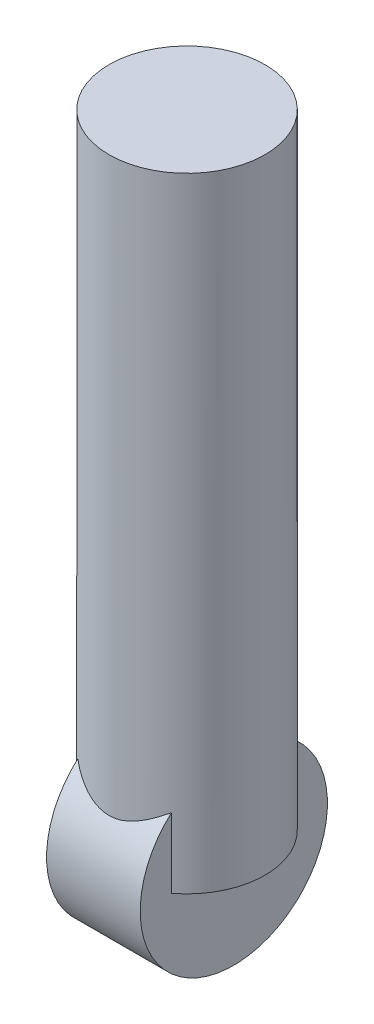
ISO-10303-21;
HEADER;
FILE_DESCRIPTION(('STEP AP214'),'2;1');
FILE_NAME('part.step','',(''),(''),'','','');
FILE_SCHEMA(('AUTOMOTIVE_DESIGN { 1 0 10303 214 1 1 1 1 }'));
ENDSEC;
DATA;
#1=APPLICATION_CONTEXT('core data for automotive mechanical design processes');
#2=APPLICATION_PROTOCOL_DEFINITION('international standard','automotive_design',2000,#1);
#3=PRODUCT_CONTEXT('',#1,'mechanical');
#4=PRODUCT('Part','Part','',(#3));
#5=PRODUCT_RELATED_PRODUCT_CATEGORY('part','',(#4));
#6=PRODUCT_DEFINITION_FORMATION('','',#4);
#7=PRODUCT_DEFINITION_CONTEXT('part definition',#1,'design');
#8=PRODUCT_DEFINITION('design','',#6,#7);
#9=PRODUCT_DEFINITION_SHAPE('','',#8);
#10=(LENGTH_UNIT() NAMED_UNIT(*) SI_UNIT(.MILLI.,.METRE.));
#11=(NAMED_UNIT(*) PLANE_ANGLE_UNIT() SI_UNIT($,.RADIAN.));
#12=(NAMED_UNIT(*) SI_UNIT($,.STERADIAN.) SOLID_ANGLE_UNIT());
#13=UNCERTAINTY_MEASURE_WITH_UNIT(LENGTH_MEASURE(1.E-05),#10,'distance_accuracy_value','');
#14=(GEOMETRIC_REPRESENTATION_CONTEXT(3) GLOBAL_UNCERTAINTY_ASSIGNED_CONTEXT((#13)) GLOBAL_UNIT_ASSIGNED_CONTEXT((#10,
#11,#12)) REPRESENTATION_CONTEXT('',''));
#15=CARTESIAN_POINT('',(0.,0.,0.));
#16=DIRECTION('',(0.,0.,1.));
#17=DIRECTION('',(1.,0.,0.));
#18=AXIS2_PLACEMENT_3D('',#15,#16,#17);
#19=CARTESIAN_POINT('',(0.,0.,0.));
#20=DIRECTION('',(0.,1.,0.));
#21=DIRECTION('',(0.,0.,1.));
#22=AXIS2_PLACEMENT_3D('',#19,#20,#21);
#23=PLANE('',#22);
#24=DIRECTION('',(0.,0.,-1.));
#25=VECTOR('',#24,1.);
#26=CARTESIAN_POINT('',(-15.,0.,0.));
#27=LINE('',#26,#25);
#28=CARTESIAN_POINT('',(-15.,0.,20.));
#29=VERTEX_POINT('',#28);
#30=CARTESIAN_POINT('',(-15.,0.,-20.));
#31=VERTEX_POINT('',#30);
#32=EDGE_CURVE('E77',#29,#31,#27,.T.);
#33=ORIENTED_EDGE('',*,*,#32,.F.);
#34=CARTESIAN_POINT('',(0.,0.,0.));
#35=DIRECTION('',(0.,1.,0.));
#36=DIRECTION('',(0.,0.,1.));
#37=AXIS2_PLACEMENT_3D('',#34,#35,#36);
#38=CIRCLE('',#37,25.);
#39=EDGE_CURVE('E74',#31,#29,#38,.T.);
#40=ORIENTED_EDGE('',*,*,#39,.F.);
#41=EDGE_LOOP('',(#33,#40));
#42=FACE_BOUND('',#41,.T.);
#43=ADVANCED_FACE('F33',(#42),#23,.F.);
#44=CARTESIAN_POINT('',(0.,200.,0.));
#45=DIRECTION('',(0.,-1.,0.));
#46=DIRECTION('',(0.,0.,-1.));
#47=AXIS2_PLACEMENT_3D('',#44,#45,#46);
#48=CYLINDRICAL_SURFACE('',#47,25.);
#49=CARTESIAN_POINT('',(0.,200.,0.));
#50=DIRECTION('',(0.,1.,0.));
#51=DIRECTION('',(0.,0.,1.));
#52=AXIS2_PLACEMENT_3D('',#49,#50,#51);
#53=CIRCLE('',#52,25.);
#54=CARTESIAN_POINT('',(0.,200.,25.));
#55=VERTEX_POINT('',#54);
#56=EDGE_CURVE('E91',#55,#55,#53,.T.);
#57=ORIENTED_EDGE('',*,*,#56,.F.);
#58=EDGE_LOOP('',(#57));
#59=FACE_BOUND('',#58,.T.);
#60=CARTESIAN_POINT('',(15.,22.3606797749979,20.));
#61=CARTESIAN_POINT('',(14.7505333881141,22.1933485372813,20.1870895665549));
#62=CARTESIAN_POINT('',(14.4976013701805,22.0259572678637,20.3695059629026));
#63=CARTESIAN_POINT('',(13.984770955398,21.6918369729914,20.7249518961479));
#64=CARTESIAN_POINT('',(13.7248721377267,21.5251079882428,20.8979808640899));
#65=CARTESIAN_POINT('',(13.1976277860819,21.1928156750195,21.2348922647635));
#66=CARTESIAN_POINT('',(12.9302696683643,21.0272549908232,21.3987576405117));
#67=CARTESIAN_POINT('',(12.3885020958379,20.6985188623841,21.7168984063848));
#68=CARTESIAN_POINT('',(12.1140927527183,20.5353433804246,21.8711739482772));
#69=CARTESIAN_POINT('',(11.2700786282488,20.0449958391043,22.3248405224954));
#70=CARTESIAN_POINT('',(10.6891224965952,19.7230262297724,22.6090206517832));
#71=CARTESIAN_POINT('',(9.49659072166293,19.1030348384226,23.1352356240808));
#72=CARTESIAN_POINT('',(8.88503994538071,18.8049941045188,23.3773040008827));
#73=CARTESIAN_POINT('',(7.84497126030824,18.3414168283971,23.7412569494084));
#74=CARTESIAN_POINT('',(7.42554436785161,18.1654721131729,23.8759003965315));
#75=CARTESIAN_POINT('',(6.57269431708134,17.8338429677432,24.1246132853297));
#76=CARTESIAN_POINT('',(6.13927123624068,17.6781584254157,24.2386828408642));
#77=CARTESIAN_POINT('',(5.261423217624,17.3928527883917,24.4442112064521));
#78=CARTESIAN_POINT('',(4.81707354927075,17.2630905180977,24.5357931494226));
#79=CARTESIAN_POINT('',(3.91648086673883,17.0337748290413,24.6955487715468));
#80=CARTESIAN_POINT('',(3.46024048448537,16.9342147858703,24.7637275842607));
#81=CARTESIAN_POINT('',(2.60836453973929,16.7825948550927,24.8666761486076));
#82=CARTESIAN_POINT('',(2.21402771683465,16.7256218974077,24.9049439308804));
#83=CARTESIAN_POINT('',(1.42097583704049,16.639228632694,24.9627485080242));
#84=CARTESIAN_POINT('',(1.02226128597008,16.6098051756924,24.9822874443324));
#85=CARTESIAN_POINT('',(0.22327171187946,16.5798220058181,25.002196623743));
#86=CARTESIAN_POINT('',(-0.177003258856212,16.5792613340217,25.0025675036759));
#87=CARTESIAN_POINT('',(-0.976109394506941,16.6070260295593,24.9841340399335));
#88=CARTESIAN_POINT('',(-1.37494049988374,16.6353525747534,24.9653289143673));
#89=CARTESIAN_POINT('',(-2.16652030714677,16.7194363193586,24.9090939713156));
#90=CARTESIAN_POINT('',(-2.55928822229833,16.7750704045384,24.8717477366118));
#91=CARTESIAN_POINT('',(-3.33825617041809,16.9114406924301,24.7792237557744));
#92=CARTESIAN_POINT('',(-3.72445612185149,16.9921772065243,24.7240457884473));
#93=CARTESIAN_POINT('',(-4.48928022795227,17.1760165443721,24.5966855087843));
#94=CARTESIAN_POINT('',(-4.86789073337734,17.2791562966902,24.5244751038009));
#95=CARTESIAN_POINT('',(-5.61594559196705,17.5046161277312,24.3640631842886));
#96=CARTESIAN_POINT('',(-5.98538705582526,17.6269421656536,24.2758567000938));
#97=CARTESIAN_POINT('',(-6.97225053139139,17.9798301419036,24.0166958440562));
#98=CARTESIAN_POINT('',(-7.5804248065674,18.2257927114594,23.8313141160917));
#99=CARTESIAN_POINT('',(-8.76829425211815,18.750965046318,23.4203460224254));
#100=CARTESIAN_POINT('',(-9.34796706675509,19.0302003401414,23.1947287191774));
#101=CARTESIAN_POINT('',(-10.4802234271221,19.6111911751606,22.705629254342));
#102=CARTESIAN_POINT('',(-11.0327738321779,19.9129731841759,22.4421022435035));
#103=CARTESIAN_POINT('',(-12.110917501539,20.5299551045294,21.8791065804401));
#104=CARTESIAN_POINT('',(-12.636524321464,20.8451481196217,21.5796562600433));
#105=CARTESIAN_POINT('',(-13.4681767181354,21.3618684651961,21.0653483528224));
#106=CARTESIAN_POINT('',(-13.7821935823242,21.5613800266166,20.8612391909664));
#107=CARTESIAN_POINT('',(-14.3990882722018,21.9608515795228,20.4402784136206));
#108=CARTESIAN_POINT('',(-14.7020030109163,22.1608071810555,20.2234767353799));
#109=CARTESIAN_POINT('',(-15.,22.3606797749979,20.));
#110=B_SPLINE_CURVE_WITH_KNOTS('',3,(#60,#61,#62,#63,#64,#65,#66,#67,#68,#69,#70,#71,#72,#73,
#74,#75,#76,#77,#78,#79,#80,#81,#82,#83,#84,#85,#86,#87,#88,#89,#90,#91,#92,#93,#94,#95,#96,#97,
#98,#99,#100,#101,#102,#103,#104,#105,#106,#107,#108,#109),.UNSPECIFIED.,.F.,.F.,(4,2,2,2,2,2,2,
2,2,2,2,2,2,2,2,2,2,2,2,2,2,2,2,2,4),(0.,1.06161246775771,2.12328920628106,3.18688050614905,
4.25045496945465,6.41569285532879,8.57919858005368,10.0013272937462,11.4234481368906,
12.837599105975,14.2514396774697,15.4509264069877,16.6502759720474,17.8495856904446,
19.0489443119757,20.2429446937337,21.4369598870242,22.6329583865508,23.8293290977455,
25.871119691797,27.9144870622562,29.9602920377655,32.0050574354383,33.2777990560276,
34.5458318973056),.UNSPECIFIED.);
#111=CARTESIAN_POINT('',(15.,22.3606797749979,20.));
#112=VERTEX_POINT('',#111);
#113=CARTESIAN_POINT('',(-15.,22.3606797749979,20.));
#114=VERTEX_POINT('',#113);
#115=EDGE_CURVE('E11',#112,#114,#110,.T.);
#116=ORIENTED_EDGE('',*,*,#115,.F.);
#117=DIRECTION('',(0.,-1.,0.));
#118=VECTOR('',#117,1.);
#119=CARTESIAN_POINT('',(15.,200.,20.));
#120=LINE('',#119,#118);
#121=CARTESIAN_POINT('',(15.,0.,20.));
#122=VERTEX_POINT('',#121);
#123=EDGE_CURVE('E79',#112,#122,#120,.T.);
#124=ORIENTED_EDGE('',*,*,#123,.T.);
#125=CARTESIAN_POINT('',(15.,0.,-20.));
#126=VERTEX_POINT('',#125);
#127=EDGE_CURVE('E78',#122,#126,#38,.T.);
#128=ORIENTED_EDGE('',*,*,#127,.T.);
#129=DIRECTION('',(0.,-1.,0.));
#130=VECTOR('',#129,1.);
#131=CARTESIAN_POINT('',(15.,200.,-20.));
#132=LINE('',#131,#130);
#133=CARTESIAN_POINT('',(15.,22.3606797749979,-20.));
#134=VERTEX_POINT('',#133);
#135=EDGE_CURVE('E166',#126,#134,#132,.F.);
#136=ORIENTED_EDGE('',*,*,#135,.T.);
#137=CARTESIAN_POINT('',(-15.,22.3606797749979,-20.));
#138=CARTESIAN_POINT('',(-14.7505333881141,22.1933485372813,-20.1870895665549));
#139=CARTESIAN_POINT('',(-14.4976013701805,22.0259572678637,-20.3695059629026));
#140=CARTESIAN_POINT('',(-13.984770955398,21.6918369729914,-20.7249518961479));
#141=CARTESIAN_POINT('',(-13.7248721377267,21.5251079882428,-20.8979808640899));
#142=CARTESIAN_POINT('',(-13.1976277860819,21.1928156750195,-21.2348922647635));
#143=CARTESIAN_POINT('',(-12.9302696683643,21.0272549908232,-21.3987576405117));
#144=CARTESIAN_POINT('',(-12.3885020958379,20.6985188623841,-21.7168984063848));
#145=CARTESIAN_POINT('',(-12.1140927527183,20.5353433804246,-21.8711739482772));
#146=CARTESIAN_POINT('',(-11.2700786282488,20.0449958391043,-22.3248405224954));
#147=CARTESIAN_POINT('',(-10.6891224965952,19.7230262297724,-22.6090206517832));
#148=CARTESIAN_POINT('',(-9.49659072166293,19.1030348384226,-23.1352356240808));
#149=CARTESIAN_POINT('',(-8.88503994538071,18.8049941045188,-23.3773040008827));
#150=CARTESIAN_POINT('',(-7.84497126030824,18.3414168283971,-23.7412569494084));
#151=CARTESIAN_POINT('',(-7.42554436785161,18.1654721131729,-23.8759003965315));
#152=CARTESIAN_POINT('',(-6.57269431708134,17.8338429677432,-24.1246132853297));
#153=CARTESIAN_POINT('',(-6.13927123624068,17.6781584254157,-24.2386828408642));
#154=CARTESIAN_POINT('',(-5.261423217624,17.3928527883917,-24.4442112064521));
#155=CARTESIAN_POINT('',(-4.81707354927075,17.2630905180977,-24.5357931494226));
#156=CARTESIAN_POINT('',(-3.91648086673883,17.0337748290413,-24.6955487715468));
#157=CARTESIAN_POINT('',(-3.46024048448537,16.9342147858703,-24.7637275842607));
#158=CARTESIAN_POINT('',(-2.60836453973929,16.7825948550927,-24.8666761486076));
#159=CARTESIAN_POINT('',(-2.21402771683465,16.7256218974077,-24.9049439308804));
#160=CARTESIAN_POINT('',(-1.42097583704049,16.639228632694,-24.9627485080242));
#161=CARTESIAN_POINT('',(-1.02226128597008,16.6098051756924,-24.9822874443324));
#162=CARTESIAN_POINT('',(-0.22327171187946,16.5798220058181,-25.002196623743));
#163=CARTESIAN_POINT('',(0.177003258856212,16.5792613340217,-25.0025675036759));
#164=CARTESIAN_POINT('',(0.976109394506941,16.6070260295593,-24.9841340399335));
#165=CARTESIAN_POINT('',(1.37494049988374,16.6353525747534,-24.9653289143673));
#166=CARTESIAN_POINT('',(2.16652030714677,16.7194363193586,-24.9090939713156));
#167=CARTESIAN_POINT('',(2.55928822229833,16.7750704045384,-24.8717477366118));
#168=CARTESIAN_POINT('',(3.33825617041809,16.9114406924301,-24.7792237557744));
#169=CARTESIAN_POINT('',(3.72445612185149,16.9921772065243,-24.7240457884473));
#170=CARTESIAN_POINT('',(4.48928022795227,17.1760165443721,-24.5966855087843));
#171=CARTESIAN_POINT('',(4.86789073337734,17.2791562966902,-24.5244751038009));
#172=CARTESIAN_POINT('',(5.61594559196705,17.5046161277312,-24.3640631842886));
#173=CARTESIAN_POINT('',(5.98538705582526,17.6269421656536,-24.2758567000938));
#174=CARTESIAN_POINT('',(6.97225053139139,17.9798301419036,-24.0166958440562));
#175=CARTESIAN_POINT('',(7.5804248065674,18.2257927114594,-23.8313141160917));
#176=CARTESIAN_POINT('',(8.76829425211815,18.750965046318,-23.4203460224254));
#177=CARTESIAN_POINT('',(9.34796706675509,19.0302003401414,-23.1947287191774));
#178=CARTESIAN_POINT('',(10.4802234271221,19.6111911751606,-22.705629254342));
#179=CARTESIAN_POINT('',(11.0327738321779,19.9129731841759,-22.4421022435035));
#180=CARTESIAN_POINT('',(12.110917501539,20.5299551045294,-21.8791065804401));
#181=CARTESIAN_POINT('',(12.636524321464,20.8451481196217,-21.5796562600433));
#182=CARTESIAN_POINT('',(13.4681767181354,21.3618684651961,-21.0653483528224));
#183=CARTESIAN_POINT('',(13.7821935823242,21.5613800266166,-20.8612391909664));
#184=CARTESIAN_POINT('',(14.3990882722018,21.9608515795228,-20.4402784136206));
#185=CARTESIAN_POINT('',(14.7020030109163,22.1608071810555,-20.2234767353799));
#186=CARTESIAN_POINT('',(15.,22.3606797749979,-20.));
#187=B_SPLINE_CURVE_WITH_KNOTS('',3,(#137,#138,#139,#140,#141,#142,#143,#144,#145,#146,#147,
#148,#149,#150,#151,#152,#153,#154,#155,#156,#157,#158,#159,#160,#161,#162,#163,#164,#165,#166,
#167,#168,#169,#170,#171,#172,#173,#174,#175,#176,#177,#178,#179,#180,#181,#182,#183,#184,#185,
#186),.UNSPECIFIED.,.F.,.F.,(4,2,2,2,2,2,2,2,2,2,2,2,2,2,2,2,2,2,2,2,2,2,2,2,4),(0.,
1.06161246775771,2.12328920628106,3.18688050614905,4.25045496945465,6.41569285532879,
8.57919858005368,10.0013272937462,11.4234481368906,12.837599105975,14.2514396774697,
15.4509264069877,16.6502759720474,17.8495856904446,19.0489443119757,20.2429446937337,
21.4369598870242,22.6329583865508,23.8293290977455,25.871119691797,27.9144870622562,
29.9602920377655,32.0050574354383,33.2777990560276,34.5458318973056),.UNSPECIFIED.);
#188=CARTESIAN_POINT('',(-15.,22.3606797749979,-20.));
#189=VERTEX_POINT('',#188);
#190=EDGE_CURVE('E46',#189,#134,#187,.T.);
#191=ORIENTED_EDGE('',*,*,#190,.F.);
#192=DIRECTION('',(0.,-1.,0.));
#193=VECTOR('',#192,1.);
#194=CARTESIAN_POINT('',(-15.,200.,-20.));
#195=LINE('',#194,#193);
#196=EDGE_CURVE('E82',#31,#189,#195,.F.);
#197=ORIENTED_EDGE('',*,*,#196,.F.);
#198=ORIENTED_EDGE('',*,*,#39,.T.);
#199=DIRECTION('',(0.,-1.,0.));
#200=VECTOR('',#199,1.);
#201=CARTESIAN_POINT('',(-15.,200.,20.));
#202=LINE('',#201,#200);
#203=EDGE_CURVE('E56',#114,#29,#202,.T.);
#204=ORIENTED_EDGE('',*,*,#203,.F.);
#205=EDGE_LOOP('',(#116,#124,#128,#136,#191,#197,#198,#204));
#206=FACE_BOUND('',#205,.T.);
#207=ADVANCED_FACE('F35',(#59,#206),#48,.T.);
#208=CARTESIAN_POINT('',(0.,200.,0.));
#209=DIRECTION('',(0.,1.,0.));
#210=DIRECTION('',(0.,0.,1.));
#211=AXIS2_PLACEMENT_3D('',#208,#209,#210);
#212=PLANE('',#211);
#213=ORIENTED_EDGE('',*,*,#56,.T.);
#214=EDGE_LOOP('',(#213));
#215=FACE_BOUND('',#214,.T.);
#216=ADVANCED_FACE('F108',(#215),#212,.T.);
#217=ORIENTED_EDGE('',*,*,#127,.F.);
#218=DIRECTION('',(0.,0.,-1.));
#219=VECTOR('',#218,1.);
#220=CARTESIAN_POINT('',(15.,0.,0.));
#221=LINE('',#220,#219);
#222=EDGE_CURVE('E90',#122,#126,#221,.T.);
#223=ORIENTED_EDGE('',*,*,#222,.T.);
#224=EDGE_LOOP('',(#217,#223));
#225=FACE_BOUND('',#224,.T.);
#226=ADVANCED_FACE('F105',(#225),#23,.F.);
#227=CARTESIAN_POINT('',(15.,0.,0.));
#228=DIRECTION('',(-1.,0.,0.));
#229=DIRECTION('',(0.,0.,1.));
#230=AXIS2_PLACEMENT_3D('',#227,#228,#229);
#231=CYLINDRICAL_SURFACE('',#230,30.);
#232=CARTESIAN_POINT('',(15.,0.,0.));
#233=DIRECTION('',(1.,0.,0.));
#234=DIRECTION('',(0.,0.,-1.));
#235=AXIS2_PLACEMENT_3D('',#232,#233,#234);
#236=CIRCLE('',#235,30.);
#237=EDGE_CURVE('E87',#112,#134,#236,.T.);
#238=ORIENTED_EDGE('',*,*,#237,.F.);
#239=ORIENTED_EDGE('',*,*,#115,.T.);
#240=CARTESIAN_POINT('',(-15.,0.,0.));
#241=DIRECTION('',(1.,0.,0.));
#242=DIRECTION('',(0.,0.,-1.));
#243=AXIS2_PLACEMENT_3D('',#240,#241,#242);
#244=CIRCLE('',#243,30.);
#245=EDGE_CURVE('E168',#114,#189,#244,.T.);
#246=ORIENTED_EDGE('',*,*,#245,.T.);
#247=ORIENTED_EDGE('',*,*,#190,.T.);
#248=EDGE_LOOP('',(#238,#239,#246,#247));
#249=FACE_BOUND('',#248,.T.);
#250=ADVANCED_FACE('F99',(#249),#231,.T.);
#251=CARTESIAN_POINT('',(15.,0.,0.));
#252=DIRECTION('',(1.,0.,0.));
#253=DIRECTION('',(0.,0.,-1.));
#254=AXIS2_PLACEMENT_3D('',#251,#252,#253);
#255=PLANE('',#254);
#256=ORIENTED_EDGE('',*,*,#123,.F.);
#257=ORIENTED_EDGE('',*,*,#237,.T.);
#258=ORIENTED_EDGE('',*,*,#135,.F.);
#259=ORIENTED_EDGE('',*,*,#222,.F.);
#260=EDGE_LOOP('',(#256,#257,#258,#259));
#261=FACE_BOUND('',#260,.T.);
#262=ADVANCED_FACE('F104',(#261),#255,.T.);
#263=CARTESIAN_POINT('',(-15.,0.,0.));
#264=DIRECTION('',(1.,0.,0.));
#265=DIRECTION('',(0.,0.,-1.));
#266=AXIS2_PLACEMENT_3D('',#263,#264,#265);
#267=PLANE('',#266);
#268=ORIENTED_EDGE('',*,*,#245,.F.);
#269=ORIENTED_EDGE('',*,*,#203,.T.);
#270=ORIENTED_EDGE('',*,*,#32,.T.);
#271=ORIENTED_EDGE('',*,*,#196,.T.);
#272=EDGE_LOOP('',(#268,#269,#270,#271));
#273=FACE_BOUND('',#272,.T.);
#274=ADVANCED_FACE('F89',(#273),#267,.F.);
#275=CLOSED_SHELL('',(#43,#207,#216,#226,#250,#262,#274));
#276=MANIFOLD_SOLID_BREP('B2',#275);
#277=ADVANCED_BREP_SHAPE_REPRESENTATION('',(#18,#276),#14);
#278=SHAPE_DEFINITION_REPRESENTATION(#9,#277);
ENDSEC;
END-ISO-10303-21;
